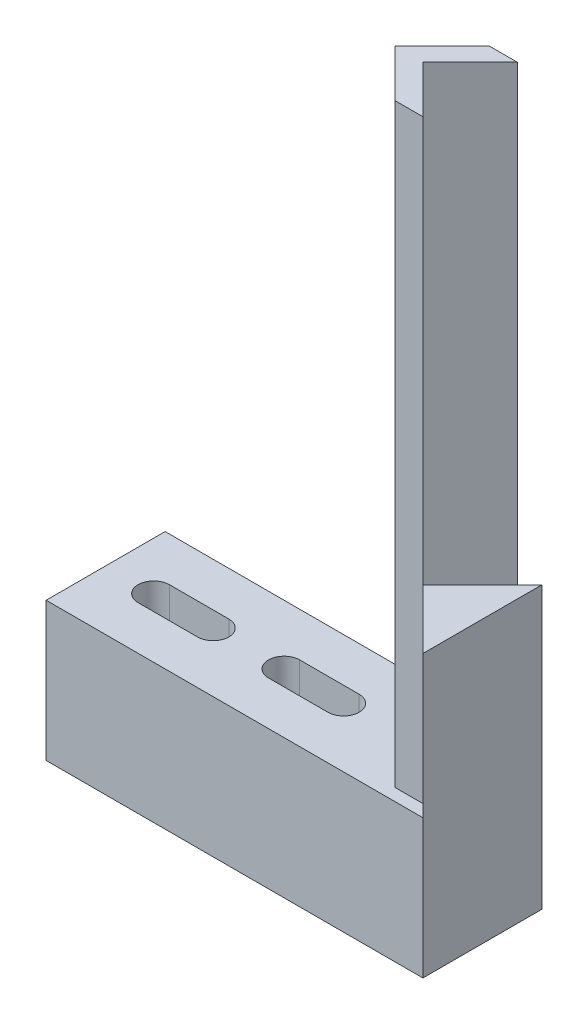
ISO-10303-21;
HEADER;
FILE_DESCRIPTION(('STEP AP214'),'2;1');
FILE_NAME('part.step','',(''),(''),'','','');
FILE_SCHEMA(('AUTOMOTIVE_DESIGN { 1 0 10303 214 1 1 1 1 }'));
ENDSEC;
DATA;
#1=APPLICATION_CONTEXT('core data for automotive mechanical design processes');
#2=APPLICATION_PROTOCOL_DEFINITION('international standard','automotive_design',2000,#1);
#3=PRODUCT_CONTEXT('',#1,'mechanical');
#4=PRODUCT('Part','Part','',(#3));
#5=PRODUCT_RELATED_PRODUCT_CATEGORY('part','',(#4));
#6=PRODUCT_DEFINITION_FORMATION('','',#4);
#7=PRODUCT_DEFINITION_CONTEXT('part definition',#1,'design');
#8=PRODUCT_DEFINITION('design','',#6,#7);
#9=PRODUCT_DEFINITION_SHAPE('','',#8);
#10=(LENGTH_UNIT() NAMED_UNIT(*) SI_UNIT(.MILLI.,.METRE.));
#11=(NAMED_UNIT(*) PLANE_ANGLE_UNIT() SI_UNIT($,.RADIAN.));
#12=(NAMED_UNIT(*) SI_UNIT($,.STERADIAN.) SOLID_ANGLE_UNIT());
#13=UNCERTAINTY_MEASURE_WITH_UNIT(LENGTH_MEASURE(1.E-05),#10,'distance_accuracy_value','');
#14=(GEOMETRIC_REPRESENTATION_CONTEXT(3) GLOBAL_UNCERTAINTY_ASSIGNED_CONTEXT((#13)) GLOBAL_UNIT_ASSIGNED_CONTEXT((#10,
#11,#12)) REPRESENTATION_CONTEXT('',''));
#15=CARTESIAN_POINT('',(0.,0.,0.));
#16=DIRECTION('',(0.,0.,1.));
#17=DIRECTION('',(1.,0.,0.));
#18=AXIS2_PLACEMENT_3D('',#15,#16,#17);
#19=CARTESIAN_POINT('',(0.,17.78,-15.24));
#20=DIRECTION('',(0.,1.,0.));
#21=DIRECTION('',(0.,0.,1.));
#22=AXIS2_PLACEMENT_3D('',#19,#20,#21);
#23=PLANE('',#22);
#24=CARTESIAN_POINT('',(30.48,17.78,-7.62));
#25=DIRECTION('',(0.,1.,0.));
#26=DIRECTION('',(0.,0.,1.));
#27=AXIS2_PLACEMENT_3D('',#24,#25,#26);
#28=CIRCLE('',#27,2.);
#29=CARTESIAN_POINT('',(30.48,17.78,-5.62));
#30=VERTEX_POINT('',#29);
#31=CARTESIAN_POINT('',(30.48,17.78,-9.62));
#32=VERTEX_POINT('',#31);
#33=EDGE_CURVE('E227',#30,#32,#28,.T.);
#34=ORIENTED_EDGE('',*,*,#33,.F.);
#35=DIRECTION('',(1.,0.,0.));
#36=VECTOR('',#35,1.);
#37=CARTESIAN_POINT('',(30.48,17.78,-5.62));
#38=LINE('',#37,#36);
#39=CARTESIAN_POINT('',(22.86,17.78,-5.62));
#40=VERTEX_POINT('',#39);
#41=EDGE_CURVE('E217',#40,#30,#38,.T.);
#42=ORIENTED_EDGE('',*,*,#41,.F.);
#43=CARTESIAN_POINT('',(22.86,17.78,-7.62));
#44=DIRECTION('',(0.,1.,0.));
#45=DIRECTION('',(0.,0.,1.));
#46=AXIS2_PLACEMENT_3D('',#43,#44,#45);
#47=CIRCLE('',#46,2.);
#48=CARTESIAN_POINT('',(22.86,17.78,-9.62));
#49=VERTEX_POINT('',#48);
#50=EDGE_CURVE('E233',#49,#40,#47,.T.);
#51=ORIENTED_EDGE('',*,*,#50,.F.);
#52=DIRECTION('',(-1.,0.,0.));
#53=VECTOR('',#52,1.);
#54=CARTESIAN_POINT('',(30.48,17.78,-9.62));
#55=LINE('',#54,#53);
#56=EDGE_CURVE('E229',#32,#49,#55,.T.);
#57=ORIENTED_EDGE('',*,*,#56,.F.);
#58=EDGE_LOOP('',(#34,#42,#51,#57));
#59=FACE_BOUND('',#58,.T.);
#60=CARTESIAN_POINT('',(13.78,17.78,-7.61999999999999));
#61=DIRECTION('',(0.,1.,0.));
#62=DIRECTION('',(0.,0.,1.));
#63=AXIS2_PLACEMENT_3D('',#60,#61,#62);
#64=CIRCLE('',#63,2.);
#65=CARTESIAN_POINT('',(13.78,17.78,-5.61999999999999));
#66=VERTEX_POINT('',#65);
#67=CARTESIAN_POINT('',(13.78,17.78,-9.62));
#68=VERTEX_POINT('',#67);
#69=EDGE_CURVE('E212',#66,#68,#64,.T.);
#70=ORIENTED_EDGE('',*,*,#69,.F.);
#71=DIRECTION('',(1.,0.,0.));
#72=VECTOR('',#71,1.);
#73=CARTESIAN_POINT('',(13.78,17.78,-5.61999999999999));
#74=LINE('',#73,#72);
#75=CARTESIAN_POINT('',(6.15999999999996,17.78,-5.62));
#76=VERTEX_POINT('',#75);
#77=EDGE_CURVE('E251',#76,#66,#74,.T.);
#78=ORIENTED_EDGE('',*,*,#77,.F.);
#79=CARTESIAN_POINT('',(6.15999999999996,17.78,-7.62));
#80=DIRECTION('',(0.,1.,0.));
#81=DIRECTION('',(0.,0.,1.));
#82=AXIS2_PLACEMENT_3D('',#79,#80,#81);
#83=CIRCLE('',#82,2.);
#84=CARTESIAN_POINT('',(6.15999999999996,17.78,-9.61999999999999));
#85=VERTEX_POINT('',#84);
#86=EDGE_CURVE('E265',#85,#76,#83,.T.);
#87=ORIENTED_EDGE('',*,*,#86,.F.);
#88=DIRECTION('',(-1.,0.,0.));
#89=VECTOR('',#88,1.);
#90=CARTESIAN_POINT('',(13.78,17.78,-9.62));
#91=LINE('',#90,#89);
#92=EDGE_CURVE('E262',#68,#85,#91,.T.);
#93=ORIENTED_EDGE('',*,*,#92,.F.);
#94=EDGE_LOOP('',(#70,#78,#87,#93));
#95=FACE_BOUND('',#94,.T.);
#96=DIRECTION('',(1.,0.,0.));
#97=VECTOR('',#96,1.);
#98=CARTESIAN_POINT('',(0.,17.78,-13.6657629791449));
#99=LINE('',#98,#97);
#100=CARTESIAN_POINT('',(43.0936605307173,17.78,-13.665762979145));
#101=VERTEX_POINT('',#100);
#102=CARTESIAN_POINT('',(46.685762979145,17.78,-13.665762979145));
#103=VERTEX_POINT('',#102);
#104=EDGE_CURVE('E349',#101,#103,#99,.T.);
#105=ORIENTED_EDGE('',*,*,#104,.T.);
#106=DIRECTION('',(-0.707106781186549,0.,0.707106781186546));
#107=VECTOR('',#106,1.);
#108=CARTESIAN_POINT('',(16.5099999999999,17.78,16.51));
#109=LINE('',#108,#107);
#110=CARTESIAN_POINT('',(48.26,17.78,-15.24));
#111=VERTEX_POINT('',#110);
#112=EDGE_CURVE('E361',#111,#103,#109,.T.);
#113=ORIENTED_EDGE('',*,*,#112,.F.);
#114=DIRECTION('',(-1.,0.,0.));
#115=VECTOR('',#114,1.);
#116=CARTESIAN_POINT('',(0.,17.78,-15.24));
#117=LINE('',#116,#115);
#118=CARTESIAN_POINT('',(0.,17.78,-15.24));
#119=VERTEX_POINT('',#118);
#120=EDGE_CURVE('E287',#111,#119,#117,.T.);
#121=ORIENTED_EDGE('',*,*,#120,.T.);
#122=DIRECTION('',(0.,0.,1.));
#123=VECTOR('',#122,1.);
#124=CARTESIAN_POINT('',(0.,17.78,-15.24));
#125=LINE('',#124,#123);
#126=CARTESIAN_POINT('',(0.,17.78,0.));
#127=VERTEX_POINT('',#126);
#128=EDGE_CURVE('E11',#119,#127,#125,.T.);
#129=ORIENTED_EDGE('',*,*,#128,.T.);
#130=DIRECTION('',(-1.,0.,0.));
#131=VECTOR('',#130,1.);
#132=CARTESIAN_POINT('',(0.,17.78,0.));
#133=LINE('',#132,#131);
#134=CARTESIAN_POINT('',(48.26,17.78,0.));
#135=VERTEX_POINT('',#134);
#136=EDGE_CURVE('E281',#135,#127,#133,.T.);
#137=ORIENTED_EDGE('',*,*,#136,.F.);
#138=DIRECTION('',(0.707106781186549,0.,0.707106781186546));
#139=VECTOR('',#138,1.);
#140=CARTESIAN_POINT('',(24.1299999999999,17.78,-24.13));
#141=LINE('',#140,#139);
#142=CARTESIAN_POINT('',(46.685762979145,17.78,-1.57423702085503));
#143=VERTEX_POINT('',#142);
#144=EDGE_CURVE('E185',#143,#135,#141,.T.);
#145=ORIENTED_EDGE('',*,*,#144,.F.);
#146=DIRECTION('',(1.,0.,0.));
#147=VECTOR('',#146,1.);
#148=CARTESIAN_POINT('',(0.,17.78,-1.57423702085517));
#149=LINE('',#148,#147);
#150=CARTESIAN_POINT('',(43.0936605307173,17.78,-1.57423702085504));
#151=VERTEX_POINT('',#150);
#152=EDGE_CURVE('E347',#151,#143,#149,.T.);
#153=ORIENTED_EDGE('',*,*,#152,.F.);
#154=DIRECTION('',(0.70710678118655,0.,0.707106781186545));
#155=VECTOR('',#154,1.);
#156=CARTESIAN_POINT('',(22.333948775786,17.78,-22.3339487757862));
#157=LINE('',#156,#155);
#158=CARTESIAN_POINT('',(37.0478975515723,17.78,-7.62));
#159=VERTEX_POINT('',#158);
#160=EDGE_CURVE('E54',#159,#151,#157,.T.);
#161=ORIENTED_EDGE('',*,*,#160,.F.);
#162=DIRECTION('',(-0.70710678118655,0.,0.707106781186546));
#163=VECTOR('',#162,1.);
#164=CARTESIAN_POINT('',(14.713948775786,17.78,14.7139487757861));
#165=LINE('',#164,#163);
#166=EDGE_CURVE('E58',#101,#159,#165,.T.);
#167=ORIENTED_EDGE('',*,*,#166,.F.);
#168=EDGE_LOOP('',(#105,#113,#121,#129,#137,#145,#153,#161,#167));
#169=FACE_BOUND('',#168,.T.);
#170=ADVANCED_FACE('F37',(#59,#95,#169),#23,.T.);
#171=CARTESIAN_POINT('',(0.,0.,-15.24));
#172=DIRECTION('',(-1.,0.,0.));
#173=DIRECTION('',(0.,0.,1.));
#174=AXIS2_PLACEMENT_3D('',#171,#172,#173);
#175=PLANE('',#174);
#176=DIRECTION('',(0.,-1.,0.));
#177=VECTOR('',#176,1.);
#178=CARTESIAN_POINT('',(0.,0.,0.));
#179=LINE('',#178,#177);
#180=CARTESIAN_POINT('',(0.,0.,0.));
#181=VERTEX_POINT('',#180);
#182=EDGE_CURVE('E240',#127,#181,#179,.T.);
#183=ORIENTED_EDGE('',*,*,#182,.F.);
#184=ORIENTED_EDGE('',*,*,#128,.F.);
#185=DIRECTION('',(0.,-1.,0.));
#186=VECTOR('',#185,1.);
#187=CARTESIAN_POINT('',(0.,0.,-15.24));
#188=LINE('',#187,#186);
#189=CARTESIAN_POINT('',(0.,0.,-15.24));
#190=VERTEX_POINT('',#189);
#191=EDGE_CURVE('E277',#119,#190,#188,.T.);
#192=ORIENTED_EDGE('',*,*,#191,.T.);
#193=DIRECTION('',(0.,0.,1.));
#194=VECTOR('',#193,1.);
#195=CARTESIAN_POINT('',(0.,0.,-15.24));
#196=LINE('',#195,#194);
#197=EDGE_CURVE('E41',#190,#181,#196,.T.);
#198=ORIENTED_EDGE('',*,*,#197,.T.);
#199=EDGE_LOOP('',(#183,#184,#192,#198));
#200=FACE_BOUND('',#199,.T.);
#201=ADVANCED_FACE('F39',(#200),#175,.T.);
#202=CARTESIAN_POINT('',(48.26,0.,-15.24));
#203=DIRECTION('',(1.,0.,0.));
#204=DIRECTION('',(0.,0.,-1.));
#205=AXIS2_PLACEMENT_3D('',#202,#203,#204);
#206=PLANE('',#205);
#207=DIRECTION('',(0.,1.,0.));
#208=VECTOR('',#207,1.);
#209=CARTESIAN_POINT('',(48.26,0.,0.));
#210=LINE('',#209,#208);
#211=CARTESIAN_POINT('',(48.26,0.,0.));
#212=VERTEX_POINT('',#211);
#213=EDGE_CURVE('E295',#212,#135,#210,.T.);
#214=ORIENTED_EDGE('',*,*,#213,.F.);
#215=DIRECTION('',(0.,0.,1.));
#216=VECTOR('',#215,1.);
#217=CARTESIAN_POINT('',(48.26,0.,-15.24));
#218=LINE('',#217,#216);
#219=CARTESIAN_POINT('',(48.26,0.,-15.24));
#220=VERTEX_POINT('',#219);
#221=EDGE_CURVE('E46',#220,#212,#218,.T.);
#222=ORIENTED_EDGE('',*,*,#221,.F.);
#223=DIRECTION('',(0.,1.,0.));
#224=VECTOR('',#223,1.);
#225=CARTESIAN_POINT('',(48.26,0.,-15.24));
#226=LINE('',#225,#224);
#227=EDGE_CURVE('E284',#220,#111,#226,.T.);
#228=ORIENTED_EDGE('',*,*,#227,.T.);
#229=DIRECTION('',(0.,-1.,0.));
#230=VECTOR('',#229,1.);
#231=CARTESIAN_POINT('',(48.26,35.99999912,-15.24));
#232=LINE('',#231,#230);
#233=CARTESIAN_POINT('',(48.26,35.99999912,-15.24));
#234=VERTEX_POINT('',#233);
#235=EDGE_CURVE('E321',#234,#111,#232,.T.);
#236=ORIENTED_EDGE('',*,*,#235,.F.);
#237=DIRECTION('',(0.,0.,-1.));
#238=VECTOR('',#237,1.);
#239=CARTESIAN_POINT('',(48.26,35.99999912,0.));
#240=LINE('',#239,#238);
#241=CARTESIAN_POINT('',(48.26,35.99999912,0.));
#242=VERTEX_POINT('',#241);
#243=EDGE_CURVE('E195',#242,#234,#240,.T.);
#244=ORIENTED_EDGE('',*,*,#243,.F.);
#245=DIRECTION('',(0.,-1.,0.));
#246=VECTOR('',#245,1.);
#247=CARTESIAN_POINT('',(48.26,35.99999912,0.));
#248=LINE('',#247,#246);
#249=EDGE_CURVE('E324',#242,#135,#248,.T.);
#250=ORIENTED_EDGE('',*,*,#249,.T.);
#251=EDGE_LOOP('',(#214,#222,#228,#236,#244,#250));
#252=FACE_BOUND('',#251,.T.);
#253=ADVANCED_FACE('F319',(#252),#206,.T.);
#254=CARTESIAN_POINT('',(0.,0.,-15.24));
#255=DIRECTION('',(0.,-1.,0.));
#256=DIRECTION('',(0.,0.,-1.));
#257=AXIS2_PLACEMENT_3D('',#254,#255,#256);
#258=PLANE('',#257);
#259=CARTESIAN_POINT('',(30.48,0.,-7.62));
#260=DIRECTION('',(0.,1.,0.));
#261=DIRECTION('',(0.,0.,1.));
#262=AXIS2_PLACEMENT_3D('',#259,#260,#261);
#263=CIRCLE('',#262,2.);
#264=CARTESIAN_POINT('',(30.48,0.,-5.62));
#265=VERTEX_POINT('',#264);
#266=CARTESIAN_POINT('',(30.48,0.,-9.62));
#267=VERTEX_POINT('',#266);
#268=EDGE_CURVE('E213',#265,#267,#263,.T.);
#269=ORIENTED_EDGE('',*,*,#268,.T.);
#270=DIRECTION('',(-1.,0.,0.));
#271=VECTOR('',#270,1.);
#272=CARTESIAN_POINT('',(30.48,0.,-9.62));
#273=LINE('',#272,#271);
#274=CARTESIAN_POINT('',(22.86,0.,-9.62));
#275=VERTEX_POINT('',#274);
#276=EDGE_CURVE('E216',#267,#275,#273,.T.);
#277=ORIENTED_EDGE('',*,*,#276,.T.);
#278=CARTESIAN_POINT('',(22.86,0.,-7.62));
#279=DIRECTION('',(0.,1.,0.));
#280=DIRECTION('',(0.,0.,1.));
#281=AXIS2_PLACEMENT_3D('',#278,#279,#280);
#282=CIRCLE('',#281,2.);
#283=CARTESIAN_POINT('',(22.86,0.,-5.62));
#284=VERTEX_POINT('',#283);
#285=EDGE_CURVE('E220',#275,#284,#282,.T.);
#286=ORIENTED_EDGE('',*,*,#285,.T.);
#287=DIRECTION('',(1.,0.,0.));
#288=VECTOR('',#287,1.);
#289=CARTESIAN_POINT('',(30.48,0.,-5.62));
#290=LINE('',#289,#288);
#291=EDGE_CURVE('E223',#284,#265,#290,.T.);
#292=ORIENTED_EDGE('',*,*,#291,.T.);
#293=EDGE_LOOP('',(#269,#277,#286,#292));
#294=FACE_BOUND('',#293,.T.);
#295=CARTESIAN_POINT('',(13.78,0.,-7.61999999999999));
#296=DIRECTION('',(0.,1.,0.));
#297=DIRECTION('',(0.,0.,1.));
#298=AXIS2_PLACEMENT_3D('',#295,#296,#297);
#299=CIRCLE('',#298,2.);
#300=CARTESIAN_POINT('',(13.78,0.,-5.61999999999999));
#301=VERTEX_POINT('',#300);
#302=CARTESIAN_POINT('',(13.78,0.,-9.62));
#303=VERTEX_POINT('',#302);
#304=EDGE_CURVE('E247',#301,#303,#299,.T.);
#305=ORIENTED_EDGE('',*,*,#304,.T.);
#306=DIRECTION('',(-1.,0.,0.));
#307=VECTOR('',#306,1.);
#308=CARTESIAN_POINT('',(13.78,0.,-9.62));
#309=LINE('',#308,#307);
#310=CARTESIAN_POINT('',(6.15999999999996,0.,-9.62));
#311=VERTEX_POINT('',#310);
#312=EDGE_CURVE('E250',#303,#311,#309,.T.);
#313=ORIENTED_EDGE('',*,*,#312,.T.);
#314=CARTESIAN_POINT('',(6.15999999999996,0.,-7.62));
#315=DIRECTION('',(0.,1.,0.));
#316=DIRECTION('',(0.,0.,1.));
#317=AXIS2_PLACEMENT_3D('',#314,#315,#316);
#318=CIRCLE('',#317,2.);
#319=CARTESIAN_POINT('',(6.15999999999996,0.,-5.62));
#320=VERTEX_POINT('',#319);
#321=EDGE_CURVE('E254',#311,#320,#318,.T.);
#322=ORIENTED_EDGE('',*,*,#321,.T.);
#323=DIRECTION('',(1.,0.,0.));
#324=VECTOR('',#323,1.);
#325=CARTESIAN_POINT('',(13.78,0.,-5.61999999999999));
#326=LINE('',#325,#324);
#327=EDGE_CURVE('E257',#320,#301,#326,.T.);
#328=ORIENTED_EDGE('',*,*,#327,.T.);
#329=EDGE_LOOP('',(#305,#313,#322,#328));
#330=FACE_BOUND('',#329,.T.);
#331=DIRECTION('',(1.,0.,0.));
#332=VECTOR('',#331,1.);
#333=CARTESIAN_POINT('',(0.,0.,0.));
#334=LINE('',#333,#332);
#335=EDGE_CURVE('E292',#181,#212,#334,.T.);
#336=ORIENTED_EDGE('',*,*,#335,.F.);
#337=ORIENTED_EDGE('',*,*,#197,.F.);
#338=DIRECTION('',(1.,0.,0.));
#339=VECTOR('',#338,1.);
#340=CARTESIAN_POINT('',(0.,0.,-15.24));
#341=LINE('',#340,#339);
#342=EDGE_CURVE('E280',#190,#220,#341,.T.);
#343=ORIENTED_EDGE('',*,*,#342,.T.);
#344=ORIENTED_EDGE('',*,*,#221,.T.);
#345=EDGE_LOOP('',(#336,#337,#343,#344));
#346=FACE_BOUND('',#345,.T.);
#347=ADVANCED_FACE('F306',(#294,#330,#346),#258,.T.);
#348=CARTESIAN_POINT('',(0.,0.,-15.24));
#349=DIRECTION('',(0.,0.,-1.));
#350=DIRECTION('',(-1.,0.,0.));
#351=AXIS2_PLACEMENT_3D('',#348,#349,#350);
#352=PLANE('',#351);
#353=ORIENTED_EDGE('',*,*,#191,.F.);
#354=ORIENTED_EDGE('',*,*,#120,.F.);
#355=ORIENTED_EDGE('',*,*,#227,.F.);
#356=ORIENTED_EDGE('',*,*,#342,.F.);
#357=EDGE_LOOP('',(#353,#354,#355,#356));
#358=FACE_BOUND('',#357,.T.);
#359=ADVANCED_FACE('F315',(#358),#352,.T.);
#360=CARTESIAN_POINT('',(0.,0.,0.));
#361=DIRECTION('',(0.,0.,-1.));
#362=DIRECTION('',(-1.,0.,0.));
#363=AXIS2_PLACEMENT_3D('',#360,#361,#362);
#364=PLANE('',#363);
#365=ORIENTED_EDGE('',*,*,#182,.T.);
#366=ORIENTED_EDGE('',*,*,#335,.T.);
#367=ORIENTED_EDGE('',*,*,#213,.T.);
#368=ORIENTED_EDGE('',*,*,#136,.T.);
#369=EDGE_LOOP('',(#365,#366,#367,#368));
#370=FACE_BOUND('',#369,.T.);
#371=ADVANCED_FACE('F308',(#370),#364,.F.);
#372=CARTESIAN_POINT('',(13.78,0.,-7.61999999999999));
#373=DIRECTION('',(0.,1.,0.));
#374=DIRECTION('',(0.,0.,1.));
#375=AXIS2_PLACEMENT_3D('',#372,#373,#374);
#376=CYLINDRICAL_SURFACE('',#375,2.);
#377=ORIENTED_EDGE('',*,*,#69,.T.);
#378=DIRECTION('',(0.,1.,0.));
#379=VECTOR('',#378,1.);
#380=CARTESIAN_POINT('',(13.78,0.,-9.62));
#381=LINE('',#380,#379);
#382=EDGE_CURVE('E260',#303,#68,#381,.T.);
#383=ORIENTED_EDGE('',*,*,#382,.F.);
#384=ORIENTED_EDGE('',*,*,#304,.F.);
#385=DIRECTION('',(0.,1.,0.));
#386=VECTOR('',#385,1.);
#387=CARTESIAN_POINT('',(13.78,0.,-5.61999999999999));
#388=LINE('',#387,#386);
#389=EDGE_CURVE('E230',#301,#66,#388,.T.);
#390=ORIENTED_EDGE('',*,*,#389,.T.);
#391=EDGE_LOOP('',(#377,#383,#384,#390));
#392=FACE_BOUND('',#391,.T.);
#393=ADVANCED_FACE('F409',(#392),#376,.F.);
#394=CARTESIAN_POINT('',(13.78,0.,-5.61999999999999));
#395=DIRECTION('',(0.,0.,1.));
#396=DIRECTION('',(1.,0.,0.));
#397=AXIS2_PLACEMENT_3D('',#394,#395,#396);
#398=PLANE('',#397);
#399=ORIENTED_EDGE('',*,*,#77,.T.);
#400=ORIENTED_EDGE('',*,*,#389,.F.);
#401=ORIENTED_EDGE('',*,*,#327,.F.);
#402=DIRECTION('',(0.,1.,0.));
#403=VECTOR('',#402,1.);
#404=CARTESIAN_POINT('',(6.15999999999996,0.,-5.62));
#405=LINE('',#404,#403);
#406=EDGE_CURVE('E271',#320,#76,#405,.T.);
#407=ORIENTED_EDGE('',*,*,#406,.T.);
#408=EDGE_LOOP('',(#399,#400,#401,#407));
#409=FACE_BOUND('',#408,.T.);
#410=ADVANCED_FACE('F420',(#409),#398,.F.);
#411=CARTESIAN_POINT('',(6.15999999999996,0.,-7.62));
#412=DIRECTION('',(0.,1.,0.));
#413=DIRECTION('',(0.,0.,1.));
#414=AXIS2_PLACEMENT_3D('',#411,#412,#413);
#415=CYLINDRICAL_SURFACE('',#414,2.);
#416=ORIENTED_EDGE('',*,*,#86,.T.);
#417=ORIENTED_EDGE('',*,*,#406,.F.);
#418=ORIENTED_EDGE('',*,*,#321,.F.);
#419=DIRECTION('',(0.,1.,0.));
#420=VECTOR('',#419,1.);
#421=CARTESIAN_POINT('',(6.15999999999996,0.,-9.61999999999999));
#422=LINE('',#421,#420);
#423=EDGE_CURVE('E273',#311,#85,#422,.T.);
#424=ORIENTED_EDGE('',*,*,#423,.T.);
#425=EDGE_LOOP('',(#416,#417,#418,#424));
#426=FACE_BOUND('',#425,.T.);
#427=ADVANCED_FACE('F417',(#426),#415,.F.);
#428=CARTESIAN_POINT('',(13.78,0.,-9.62));
#429=DIRECTION('',(0.,0.,-1.));
#430=DIRECTION('',(-1.,0.,0.));
#431=AXIS2_PLACEMENT_3D('',#428,#429,#430);
#432=PLANE('',#431);
#433=ORIENTED_EDGE('',*,*,#92,.T.);
#434=ORIENTED_EDGE('',*,*,#423,.F.);
#435=ORIENTED_EDGE('',*,*,#312,.F.);
#436=ORIENTED_EDGE('',*,*,#382,.T.);
#437=EDGE_LOOP('',(#433,#434,#435,#436));
#438=FACE_BOUND('',#437,.T.);
#439=ADVANCED_FACE('F414',(#438),#432,.F.);
#440=CARTESIAN_POINT('',(30.48,0.,-7.62));
#441=DIRECTION('',(0.,1.,0.));
#442=DIRECTION('',(0.,0.,1.));
#443=AXIS2_PLACEMENT_3D('',#440,#441,#442);
#444=CYLINDRICAL_SURFACE('',#443,2.);
#445=ORIENTED_EDGE('',*,*,#33,.T.);
#446=DIRECTION('',(0.,1.,0.));
#447=VECTOR('',#446,1.);
#448=CARTESIAN_POINT('',(30.48,0.,-9.62));
#449=LINE('',#448,#447);
#450=EDGE_CURVE('E226',#267,#32,#449,.T.);
#451=ORIENTED_EDGE('',*,*,#450,.F.);
#452=ORIENTED_EDGE('',*,*,#268,.F.);
#453=DIRECTION('',(0.,1.,0.));
#454=VECTOR('',#453,1.);
#455=CARTESIAN_POINT('',(30.48,0.,-5.62));
#456=LINE('',#455,#454);
#457=EDGE_CURVE('E238',#265,#30,#456,.T.);
#458=ORIENTED_EDGE('',*,*,#457,.T.);
#459=EDGE_LOOP('',(#445,#451,#452,#458));
#460=FACE_BOUND('',#459,.T.);
#461=ADVANCED_FACE('F430',(#460),#444,.F.);
#462=CARTESIAN_POINT('',(30.48,0.,-5.62));
#463=DIRECTION('',(0.,0.,1.));
#464=DIRECTION('',(1.,0.,0.));
#465=AXIS2_PLACEMENT_3D('',#462,#463,#464);
#466=PLANE('',#465);
#467=ORIENTED_EDGE('',*,*,#41,.T.);
#468=ORIENTED_EDGE('',*,*,#457,.F.);
#469=ORIENTED_EDGE('',*,*,#291,.F.);
#470=DIRECTION('',(0.,1.,0.));
#471=VECTOR('',#470,1.);
#472=CARTESIAN_POINT('',(22.86,0.,-5.62));
#473=LINE('',#472,#471);
#474=EDGE_CURVE('E241',#284,#40,#473,.T.);
#475=ORIENTED_EDGE('',*,*,#474,.T.);
#476=EDGE_LOOP('',(#467,#468,#469,#475));
#477=FACE_BOUND('',#476,.T.);
#478=ADVANCED_FACE('F437',(#477),#466,.F.);
#479=CARTESIAN_POINT('',(22.86,0.,-7.62));
#480=DIRECTION('',(0.,1.,0.));
#481=DIRECTION('',(0.,0.,1.));
#482=AXIS2_PLACEMENT_3D('',#479,#480,#481);
#483=CYLINDRICAL_SURFACE('',#482,2.);
#484=ORIENTED_EDGE('',*,*,#50,.T.);
#485=ORIENTED_EDGE('',*,*,#474,.F.);
#486=ORIENTED_EDGE('',*,*,#285,.F.);
#487=DIRECTION('',(0.,1.,0.));
#488=VECTOR('',#487,1.);
#489=CARTESIAN_POINT('',(22.86,0.,-9.62));
#490=LINE('',#489,#488);
#491=EDGE_CURVE('E243',#275,#49,#490,.T.);
#492=ORIENTED_EDGE('',*,*,#491,.T.);
#493=EDGE_LOOP('',(#484,#485,#486,#492));
#494=FACE_BOUND('',#493,.T.);
#495=ADVANCED_FACE('F442',(#494),#483,.F.);
#496=CARTESIAN_POINT('',(30.48,0.,-9.62));
#497=DIRECTION('',(0.,0.,-1.));
#498=DIRECTION('',(-1.,0.,0.));
#499=AXIS2_PLACEMENT_3D('',#496,#497,#498);
#500=PLANE('',#499);
#501=ORIENTED_EDGE('',*,*,#56,.T.);
#502=ORIENTED_EDGE('',*,*,#491,.F.);
#503=ORIENTED_EDGE('',*,*,#276,.F.);
#504=ORIENTED_EDGE('',*,*,#450,.T.);
#505=EDGE_LOOP('',(#501,#502,#503,#504));
#506=FACE_BOUND('',#505,.T.);
#507=ADVANCED_FACE('F449',(#506),#500,.F.);
#508=CARTESIAN_POINT('',(22.333948775786,93.98,-22.3339487757862));
#509=DIRECTION('',(0.707106781186545,0.,-0.70710678118655));
#510=DIRECTION('',(-0.70710678118655,0.,-0.707106781186545));
#511=AXIS2_PLACEMENT_3D('',#508,#509,#510);
#512=PLANE('',#511);
#513=ORIENTED_EDGE('',*,*,#160,.T.);
#514=DIRECTION('',(0.,-1.,0.));
#515=VECTOR('',#514,1.);
#516=CARTESIAN_POINT('',(43.0936605307173,93.98,-1.57423702085504));
#517=LINE('',#516,#515);
#518=CARTESIAN_POINT('',(43.0936605307173,93.98,-1.57423702085504));
#519=VERTEX_POINT('',#518);
#520=EDGE_CURVE('E204',#519,#151,#517,.T.);
#521=ORIENTED_EDGE('',*,*,#520,.F.);
#522=DIRECTION('',(0.70710678118655,0.,0.707106781186545));
#523=VECTOR('',#522,1.);
#524=CARTESIAN_POINT('',(22.333948775786,93.98,-22.3339487757862));
#525=LINE('',#524,#523);
#526=CARTESIAN_POINT('',(37.0478975515723,93.98,-7.62));
#527=VERTEX_POINT('',#526);
#528=EDGE_CURVE('E332',#527,#519,#525,.T.);
#529=ORIENTED_EDGE('',*,*,#528,.F.);
#530=DIRECTION('',(0.,-1.,0.));
#531=VECTOR('',#530,1.);
#532=CARTESIAN_POINT('',(37.0478975515723,93.98,-7.62));
#533=LINE('',#532,#531);
#534=EDGE_CURVE('E345',#527,#159,#533,.T.);
#535=ORIENTED_EDGE('',*,*,#534,.T.);
#536=EDGE_LOOP('',(#513,#521,#529,#535));
#537=FACE_BOUND('',#536,.T.);
#538=ADVANCED_FACE('F370',(#537),#512,.F.);
#539=CARTESIAN_POINT('',(0.,93.98,-1.57423702085517));
#540=DIRECTION('',(0.,0.,-1.));
#541=DIRECTION('',(-1.,0.,0.));
#542=AXIS2_PLACEMENT_3D('',#539,#540,#541);
#543=PLANE('',#542);
#544=ORIENTED_EDGE('',*,*,#152,.T.);
#545=DIRECTION('',(0.,-1.,0.));
#546=VECTOR('',#545,1.);
#547=CARTESIAN_POINT('',(46.6857629791449,93.98,-1.57423702085503));
#548=LINE('',#547,#546);
#549=CARTESIAN_POINT('',(46.685762979145,35.99999912,-1.57423702085503));
#550=VERTEX_POINT('',#549);
#551=EDGE_CURVE('E326',#550,#143,#548,.T.);
#552=ORIENTED_EDGE('',*,*,#551,.F.);
#553=DIRECTION('',(0.,-1.,0.));
#554=VECTOR('',#553,1.);
#555=CARTESIAN_POINT('',(46.6857629791449,93.98,-1.57423702085503));
#556=LINE('',#555,#554);
#557=CARTESIAN_POINT('',(46.6857629791449,93.98,-1.57423702085503));
#558=VERTEX_POINT('',#557);
#559=EDGE_CURVE('E194',#558,#550,#556,.T.);
#560=ORIENTED_EDGE('',*,*,#559,.F.);
#561=DIRECTION('',(1.,0.,0.));
#562=VECTOR('',#561,1.);
#563=CARTESIAN_POINT('',(0.,93.98,-1.57423702085517));
#564=LINE('',#563,#562);
#565=EDGE_CURVE('E335',#519,#558,#564,.T.);
#566=ORIENTED_EDGE('',*,*,#565,.F.);
#567=ORIENTED_EDGE('',*,*,#520,.T.);
#568=EDGE_LOOP('',(#544,#552,#560,#566,#567));
#569=FACE_BOUND('',#568,.T.);
#570=ADVANCED_FACE('F366',(#569),#543,.F.);
#571=CARTESIAN_POINT('',(24.1299999999999,93.98,-24.13));
#572=DIRECTION('',(0.707106781186546,0.,-0.707106781186549));
#573=DIRECTION('',(-0.707106781186549,0.,-0.707106781186546));
#574=AXIS2_PLACEMENT_3D('',#571,#572,#573);
#575=PLANE('',#574);
#576=DIRECTION('',(0.707106781186549,0.,0.707106781186546));
#577=VECTOR('',#576,1.);
#578=CARTESIAN_POINT('',(24.1299999999999,35.99999912,-24.13));
#579=LINE('',#578,#577);
#580=CARTESIAN_POINT('',(40.64,35.99999912,-7.62));
#581=VERTEX_POINT('',#580);
#582=EDGE_CURVE('E178',#581,#550,#579,.T.);
#583=ORIENTED_EDGE('',*,*,#582,.F.);
#584=DIRECTION('',(0.,-1.,0.));
#585=VECTOR('',#584,1.);
#586=CARTESIAN_POINT('',(40.6399999999999,93.98,-7.62));
#587=LINE('',#586,#585);
#588=CARTESIAN_POINT('',(40.6399999999999,93.98,-7.62));
#589=VERTEX_POINT('',#588);
#590=EDGE_CURVE('E191',#589,#581,#587,.T.);
#591=ORIENTED_EDGE('',*,*,#590,.F.);
#592=DIRECTION('',(0.707106781186549,0.,0.707106781186546));
#593=VECTOR('',#592,1.);
#594=CARTESIAN_POINT('',(24.1299999999999,93.98,-24.13));
#595=LINE('',#594,#593);
#596=EDGE_CURVE('E337',#589,#558,#595,.T.);
#597=ORIENTED_EDGE('',*,*,#596,.T.);
#598=ORIENTED_EDGE('',*,*,#559,.T.);
#599=EDGE_LOOP('',(#583,#591,#597,#598));
#600=FACE_BOUND('',#599,.T.);
#601=ADVANCED_FACE('F189',(#600),#575,.T.);
#602=CARTESIAN_POINT('',(16.5099999999999,93.98,16.51));
#603=DIRECTION('',(0.707106781186546,0.,0.707106781186549));
#604=DIRECTION('',(0.707106781186549,0.,-0.707106781186546));
#605=AXIS2_PLACEMENT_3D('',#602,#603,#604);
#606=PLANE('',#605);
#607=DIRECTION('',(-0.707106781186549,0.,0.707106781186546));
#608=VECTOR('',#607,1.);
#609=CARTESIAN_POINT('',(16.5099999999999,35.99999912,16.51));
#610=LINE('',#609,#608);
#611=CARTESIAN_POINT('',(46.685762979145,35.99999912,-13.665762979145));
#612=VERTEX_POINT('',#611);
#613=EDGE_CURVE('E175',#612,#581,#610,.T.);
#614=ORIENTED_EDGE('',*,*,#613,.F.);
#615=DIRECTION('',(0.,-1.,0.));
#616=VECTOR('',#615,1.);
#617=CARTESIAN_POINT('',(46.6857629791449,93.98,-13.665762979145));
#618=LINE('',#617,#616);
#619=CARTESIAN_POINT('',(46.6857629791449,93.98,-13.665762979145));
#620=VERTEX_POINT('',#619);
#621=EDGE_CURVE('E202',#620,#612,#618,.T.);
#622=ORIENTED_EDGE('',*,*,#621,.F.);
#623=DIRECTION('',(-0.707106781186549,0.,0.707106781186546));
#624=VECTOR('',#623,1.);
#625=CARTESIAN_POINT('',(16.5099999999999,93.98,16.51));
#626=LINE('',#625,#624);
#627=EDGE_CURVE('E201',#620,#589,#626,.T.);
#628=ORIENTED_EDGE('',*,*,#627,.T.);
#629=ORIENTED_EDGE('',*,*,#590,.T.);
#630=EDGE_LOOP('',(#614,#622,#628,#629));
#631=FACE_BOUND('',#630,.T.);
#632=ADVANCED_FACE('F199',(#631),#606,.T.);
#633=CARTESIAN_POINT('',(0.,93.98,-13.6657629791449));
#634=DIRECTION('',(0.,0.,-1.));
#635=DIRECTION('',(-1.,0.,0.));
#636=AXIS2_PLACEMENT_3D('',#633,#634,#635);
#637=PLANE('',#636);
#638=ORIENTED_EDGE('',*,*,#104,.F.);
#639=DIRECTION('',(0.,-1.,0.));
#640=VECTOR('',#639,1.);
#641=CARTESIAN_POINT('',(43.0936605307173,93.98,-13.665762979145));
#642=LINE('',#641,#640);
#643=CARTESIAN_POINT('',(43.0936605307173,93.98,-13.665762979145));
#644=VERTEX_POINT('',#643);
#645=EDGE_CURVE('E353',#644,#101,#642,.T.);
#646=ORIENTED_EDGE('',*,*,#645,.F.);
#647=DIRECTION('',(1.,0.,0.));
#648=VECTOR('',#647,1.);
#649=CARTESIAN_POINT('',(0.,93.98,-13.6657629791449));
#650=LINE('',#649,#648);
#651=EDGE_CURVE('E340',#644,#620,#650,.T.);
#652=ORIENTED_EDGE('',*,*,#651,.T.);
#653=ORIENTED_EDGE('',*,*,#621,.T.);
#654=EDGE_CURVE('E206',#612,#103,#618,.T.);
#655=ORIENTED_EDGE('',*,*,#654,.T.);
#656=EDGE_LOOP('',(#638,#646,#652,#653,#655));
#657=FACE_BOUND('',#656,.T.);
#658=ADVANCED_FACE('F359',(#657),#637,.T.);
#659=CARTESIAN_POINT('',(14.713948775786,93.98,14.7139487757861));
#660=DIRECTION('',(0.707106781186546,0.,0.70710678118655));
#661=DIRECTION('',(0.70710678118655,0.,-0.707106781186546));
#662=AXIS2_PLACEMENT_3D('',#659,#660,#661);
#663=PLANE('',#662);
#664=ORIENTED_EDGE('',*,*,#166,.T.);
#665=ORIENTED_EDGE('',*,*,#534,.F.);
#666=DIRECTION('',(-0.70710678118655,0.,0.707106781186546));
#667=VECTOR('',#666,1.);
#668=CARTESIAN_POINT('',(14.713948775786,93.98,14.7139487757861));
#669=LINE('',#668,#667);
#670=EDGE_CURVE('E343',#644,#527,#669,.T.);
#671=ORIENTED_EDGE('',*,*,#670,.F.);
#672=ORIENTED_EDGE('',*,*,#645,.T.);
#673=EDGE_LOOP('',(#664,#665,#671,#672));
#674=FACE_BOUND('',#673,.T.);
#675=ADVANCED_FACE('F372',(#674),#663,.F.);
#676=CARTESIAN_POINT('',(0.,93.98,0.));
#677=DIRECTION('',(0.,1.,0.));
#678=DIRECTION('',(-1.,0.,0.));
#679=AXIS2_PLACEMENT_3D('',#676,#677,#678);
#680=PLANE('',#679);
#681=ORIENTED_EDGE('',*,*,#528,.T.);
#682=ORIENTED_EDGE('',*,*,#565,.T.);
#683=ORIENTED_EDGE('',*,*,#596,.F.);
#684=ORIENTED_EDGE('',*,*,#627,.F.);
#685=ORIENTED_EDGE('',*,*,#651,.F.);
#686=ORIENTED_EDGE('',*,*,#670,.T.);
#687=EDGE_LOOP('',(#681,#682,#683,#684,#685,#686));
#688=FACE_BOUND('',#687,.T.);
#689=ADVANCED_FACE('F375',(#688),#680,.T.);
#690=CARTESIAN_POINT('',(24.1299999999999,35.99999912,-24.13));
#691=DIRECTION('',(0.707106781186546,0.,-0.707106781186549));
#692=DIRECTION('',(-0.707106781186549,0.,-0.707106781186546));
#693=AXIS2_PLACEMENT_3D('',#690,#691,#692);
#694=PLANE('',#693);
#695=EDGE_CURVE('E196',#550,#242,#579,.T.);
#696=ORIENTED_EDGE('',*,*,#695,.F.);
#697=ORIENTED_EDGE('',*,*,#551,.T.);
#698=ORIENTED_EDGE('',*,*,#144,.T.);
#699=ORIENTED_EDGE('',*,*,#249,.F.);
#700=EDGE_LOOP('',(#696,#697,#698,#699));
#701=FACE_BOUND('',#700,.T.);
#702=ADVANCED_FACE('F364',(#701),#694,.F.);
#703=CARTESIAN_POINT('',(16.5099999999999,35.99999912,16.51));
#704=DIRECTION('',(0.707106781186546,0.,0.707106781186549));
#705=DIRECTION('',(0.707106781186549,0.,-0.707106781186546));
#706=AXIS2_PLACEMENT_3D('',#703,#704,#705);
#707=PLANE('',#706);
#708=ORIENTED_EDGE('',*,*,#654,.F.);
#709=EDGE_CURVE('E181',#234,#612,#610,.T.);
#710=ORIENTED_EDGE('',*,*,#709,.F.);
#711=ORIENTED_EDGE('',*,*,#235,.T.);
#712=ORIENTED_EDGE('',*,*,#112,.T.);
#713=EDGE_LOOP('',(#708,#710,#711,#712));
#714=FACE_BOUND('',#713,.T.);
#715=ADVANCED_FACE('F382',(#714),#707,.F.);
#716=CARTESIAN_POINT('',(0.,35.99999912,0.));
#717=DIRECTION('',(0.,1.,0.));
#718=DIRECTION('',(-1.,0.,0.));
#719=AXIS2_PLACEMENT_3D('',#716,#717,#718);
#720=PLANE('',#719);
#721=ORIENTED_EDGE('',*,*,#709,.T.);
#722=ORIENTED_EDGE('',*,*,#613,.T.);
#723=ORIENTED_EDGE('',*,*,#582,.T.);
#724=ORIENTED_EDGE('',*,*,#695,.T.);
#725=ORIENTED_EDGE('',*,*,#243,.T.);
#726=EDGE_LOOP('',(#721,#722,#723,#724,#725));
#727=FACE_BOUND('',#726,.T.);
#728=ADVANCED_FACE('F177',(#727),#720,.T.);
#729=CLOSED_SHELL('',(#170,#201,#253,#347,#359,#371,#393,#410,#427,#439,#461,#478,#495,#507,
#538,#570,#601,#632,#658,#675,#689,#702,#715,#728));
#730=MANIFOLD_SOLID_BREP('B2',#729);
#731=ADVANCED_BREP_SHAPE_REPRESENTATION('',(#18,#730),#14);
#732=SHAPE_DEFINITION_REPRESENTATION(#9,#731);
ENDSEC;
END-ISO-10303-21;
